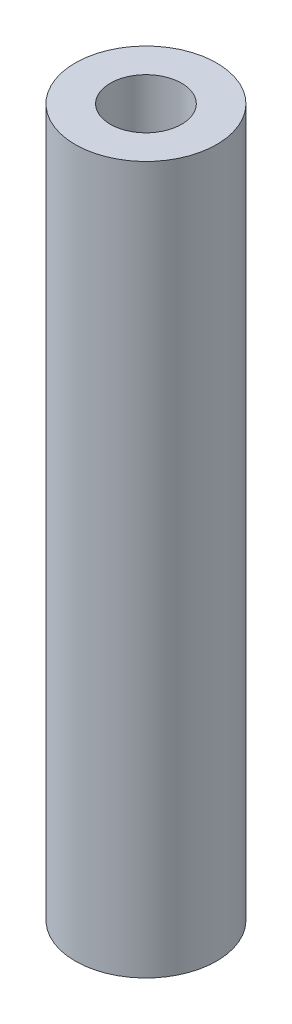
ISO-10303-21;
HEADER;
FILE_DESCRIPTION(('STEP AP214'),'2;1');
FILE_NAME('part.step','',(''),(''),'','','');
FILE_SCHEMA(('AUTOMOTIVE_DESIGN { 1 0 10303 214 1 1 1 1 }'));
ENDSEC;
DATA;
#1=APPLICATION_CONTEXT('core data for automotive mechanical design processes');
#2=APPLICATION_PROTOCOL_DEFINITION('international standard','automotive_design',2000,#1);
#3=PRODUCT_CONTEXT('',#1,'mechanical');
#4=PRODUCT('Part','Part','',(#3));
#5=PRODUCT_RELATED_PRODUCT_CATEGORY('part','',(#4));
#6=PRODUCT_DEFINITION_FORMATION('','',#4);
#7=PRODUCT_DEFINITION_CONTEXT('part definition',#1,'design');
#8=PRODUCT_DEFINITION('design','',#6,#7);
#9=PRODUCT_DEFINITION_SHAPE('','',#8);
#10=(LENGTH_UNIT() NAMED_UNIT(*) SI_UNIT(.MILLI.,.METRE.));
#11=(NAMED_UNIT(*) PLANE_ANGLE_UNIT() SI_UNIT($,.RADIAN.));
#12=(NAMED_UNIT(*) SI_UNIT($,.STERADIAN.) SOLID_ANGLE_UNIT());
#13=UNCERTAINTY_MEASURE_WITH_UNIT(LENGTH_MEASURE(1.E-05),#10,'distance_accuracy_value','');
#14=(GEOMETRIC_REPRESENTATION_CONTEXT(3) GLOBAL_UNCERTAINTY_ASSIGNED_CONTEXT((#13)) GLOBAL_UNIT_ASSIGNED_CONTEXT((#10,
#11,#12)) REPRESENTATION_CONTEXT('',''));
#15=CARTESIAN_POINT('',(0.,0.,0.));
#16=DIRECTION('',(0.,0.,1.));
#17=DIRECTION('',(1.,0.,0.));
#18=AXIS2_PLACEMENT_3D('',#15,#16,#17);
#19=CARTESIAN_POINT('',(0.,63.5,0.));
#20=DIRECTION('',(0.,1.,0.));
#21=DIRECTION('',(0.,0.,1.));
#22=AXIS2_PLACEMENT_3D('',#19,#20,#21);
#23=PLANE('',#22);
#24=CARTESIAN_POINT('',(0.,63.5,0.));
#25=DIRECTION('',(0.,1.,0.));
#26=DIRECTION('',(0.,0.,1.));
#27=AXIS2_PLACEMENT_3D('',#24,#25,#26);
#28=CIRCLE('',#27,6.35);
#29=CARTESIAN_POINT('',(0.,63.5,6.35));
#30=VERTEX_POINT('',#29);
#31=EDGE_CURVE('E10',#30,#30,#28,.T.);
#32=ORIENTED_EDGE('',*,*,#31,.T.);
#33=EDGE_LOOP('',(#32));
#34=FACE_BOUND('',#33,.T.);
#35=CARTESIAN_POINT('',(0.,63.5,0.));
#36=DIRECTION('',(0.,1.,0.));
#37=DIRECTION('',(0.,0.,1.));
#38=AXIS2_PLACEMENT_3D('',#35,#36,#37);
#39=CIRCLE('',#38,3.2004);
#40=CARTESIAN_POINT('',(0.,63.5,3.2004));
#41=VERTEX_POINT('',#40);
#42=EDGE_CURVE('E41',#41,#41,#39,.T.);
#43=ORIENTED_EDGE('',*,*,#42,.F.);
#44=EDGE_LOOP('',(#43));
#45=FACE_BOUND('',#44,.T.);
#46=ADVANCED_FACE('F30',(#34,#45),#23,.T.);
#47=CARTESIAN_POINT('',(0.,0.,0.));
#48=DIRECTION('',(0.,1.,0.));
#49=DIRECTION('',(0.,0.,1.));
#50=AXIS2_PLACEMENT_3D('',#47,#48,#49);
#51=PLANE('',#50);
#52=CARTESIAN_POINT('',(0.,0.,0.));
#53=DIRECTION('',(0.,1.,0.));
#54=DIRECTION('',(0.,0.,1.));
#55=AXIS2_PLACEMENT_3D('',#52,#53,#54);
#56=CIRCLE('',#55,6.35);
#57=CARTESIAN_POINT('',(0.,0.,6.35));
#58=VERTEX_POINT('',#57);
#59=EDGE_CURVE('E34',#58,#58,#56,.T.);
#60=ORIENTED_EDGE('',*,*,#59,.F.);
#61=EDGE_LOOP('',(#60));
#62=FACE_BOUND('',#61,.T.);
#63=CARTESIAN_POINT('',(0.,0.,0.));
#64=DIRECTION('',(0.,1.,0.));
#65=DIRECTION('',(0.,0.,1.));
#66=AXIS2_PLACEMENT_3D('',#63,#64,#65);
#67=CIRCLE('',#66,3.2004);
#68=CARTESIAN_POINT('',(0.,0.,3.2004));
#69=VERTEX_POINT('',#68);
#70=EDGE_CURVE('E43',#69,#69,#67,.T.);
#71=ORIENTED_EDGE('',*,*,#70,.T.);
#72=EDGE_LOOP('',(#71));
#73=FACE_BOUND('',#72,.T.);
#74=ADVANCED_FACE('F53',(#62,#73),#51,.F.);
#75=CARTESIAN_POINT('',(0.,63.5,0.));
#76=DIRECTION('',(0.,-1.,0.));
#77=DIRECTION('',(0.,0.,-1.));
#78=AXIS2_PLACEMENT_3D('',#75,#76,#77);
#79=CYLINDRICAL_SURFACE('',#78,6.35);
#80=ORIENTED_EDGE('',*,*,#31,.F.);
#81=EDGE_LOOP('',(#80));
#82=FACE_BOUND('',#81,.T.);
#83=ORIENTED_EDGE('',*,*,#59,.T.);
#84=EDGE_LOOP('',(#83));
#85=FACE_BOUND('',#84,.T.);
#86=ADVANCED_FACE('F32',(#82,#85),#79,.T.);
#87=CARTESIAN_POINT('',(0.,63.5,0.));
#88=DIRECTION('',(0.,-1.,0.));
#89=DIRECTION('',(0.,0.,-1.));
#90=AXIS2_PLACEMENT_3D('',#87,#88,#89);
#91=CYLINDRICAL_SURFACE('',#90,3.2004);
#92=ORIENTED_EDGE('',*,*,#42,.T.);
#93=EDGE_LOOP('',(#92));
#94=FACE_BOUND('',#93,.T.);
#95=ORIENTED_EDGE('',*,*,#70,.F.);
#96=EDGE_LOOP('',(#95));
#97=FACE_BOUND('',#96,.T.);
#98=ADVANCED_FACE('F49',(#94,#97),#91,.F.);
#99=CLOSED_SHELL('',(#46,#74,#86,#98));
#100=MANIFOLD_SOLID_BREP('B2',#99);
#101=ADVANCED_BREP_SHAPE_REPRESENTATION('',(#18,#100),#14);
#102=SHAPE_DEFINITION_REPRESENTATION(#9,#101);
ENDSEC;
END-ISO-10303-21;
